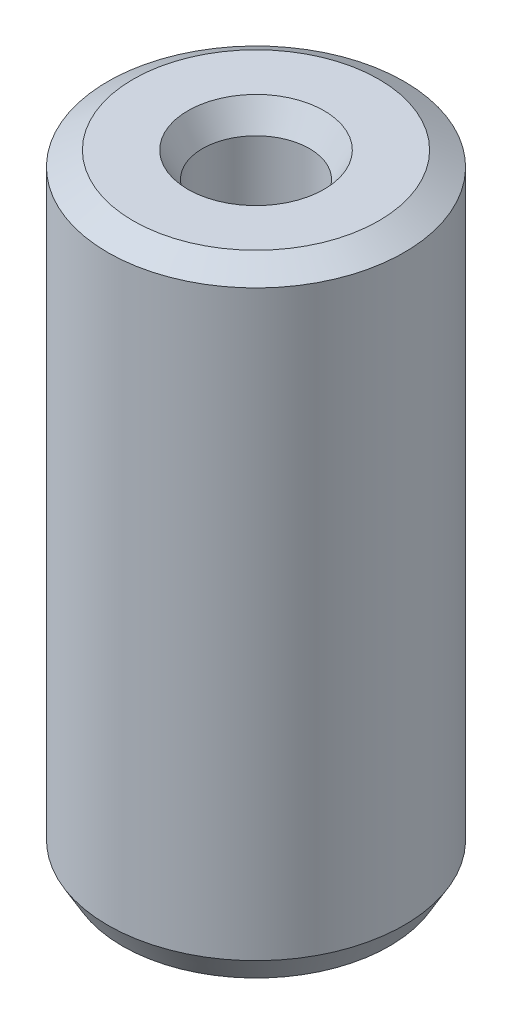
ISO-10303-21;
HEADER;
FILE_DESCRIPTION(('STEP AP214'),'2;1');
FILE_NAME('part.step','',(''),(''),'','','');
FILE_SCHEMA(('AUTOMOTIVE_DESIGN { 1 0 10303 214 1 1 1 1 }'));
ENDSEC;
DATA;
#1=APPLICATION_CONTEXT('core data for automotive mechanical design processes');
#2=APPLICATION_PROTOCOL_DEFINITION('international standard','automotive_design',2000,#1);
#3=PRODUCT_CONTEXT('',#1,'mechanical');
#4=PRODUCT('Part','Part','',(#3));
#5=PRODUCT_RELATED_PRODUCT_CATEGORY('part','',(#4));
#6=PRODUCT_DEFINITION_FORMATION('','',#4);
#7=PRODUCT_DEFINITION_CONTEXT('part definition',#1,'design');
#8=PRODUCT_DEFINITION('design','',#6,#7);
#9=PRODUCT_DEFINITION_SHAPE('','',#8);
#10=(LENGTH_UNIT() NAMED_UNIT(*) SI_UNIT(.MILLI.,.METRE.));
#11=(NAMED_UNIT(*) PLANE_ANGLE_UNIT() SI_UNIT($,.RADIAN.));
#12=(NAMED_UNIT(*) SI_UNIT($,.STERADIAN.) SOLID_ANGLE_UNIT());
#13=UNCERTAINTY_MEASURE_WITH_UNIT(LENGTH_MEASURE(1.E-05),#10,'distance_accuracy_value','');
#14=(GEOMETRIC_REPRESENTATION_CONTEXT(3) GLOBAL_UNCERTAINTY_ASSIGNED_CONTEXT((#13)) GLOBAL_UNIT_ASSIGNED_CONTEXT((#10,
#11,#12)) REPRESENTATION_CONTEXT('',''));
#15=CARTESIAN_POINT('',(0.,0.,0.));
#16=DIRECTION('',(0.,0.,1.));
#17=DIRECTION('',(1.,0.,0.));
#18=AXIS2_PLACEMENT_3D('',#15,#16,#17);
#19=CARTESIAN_POINT('',(0.,52.5242379681244,0.));
#20=DIRECTION('',(0.,-1.,0.));
#21=DIRECTION('',(0.,0.,-1.));
#22=AXIS2_PLACEMENT_3D('',#19,#20,#21);
#23=CYLINDRICAL_SURFACE('',#22,12.5);
#24=CARTESIAN_POINT('',(0.,2.14519332665176,0.));
#25=DIRECTION('',(0.,1.,0.));
#26=DIRECTION('',(0.,0.,1.));
#27=AXIS2_PLACEMENT_3D('',#24,#25,#26);
#28=CIRCLE('',#27,12.5);
#29=CARTESIAN_POINT('',(0.,2.14519332665176,-12.5));
#30=VERTEX_POINT('',#29);
#31=EDGE_CURVE('E10',#30,#30,#28,.T.);
#32=CARTESIAN_POINT('',(0.,51.2857100235182,0.));
#33=DIRECTION('',(0.,1.,0.));
#34=DIRECTION('',(0.,0.,1.));
#35=AXIS2_PLACEMENT_3D('',#32,#33,#34);
#36=CIRCLE('',#35,12.5);
#37=CARTESIAN_POINT('',(0.,51.2857100235182,-12.5));
#38=VERTEX_POINT('',#37);
#39=EDGE_CURVE('E50',#38,#38,#36,.F.);
#40=CARTESIAN_POINT('',(0.,2.14519332665176,-12.5));
#41=CARTESIAN_POINT('',(0.,2.65707370891078,-12.5));
#42=CARTESIAN_POINT('',(0.,3.16895409116981,-12.5));
#43=CARTESIAN_POINT('',(0.,4.19271485568786,-12.5));
#44=CARTESIAN_POINT('',(0.,4.70459523794689,-12.5));
#45=CARTESIAN_POINT('',(0.,5.72835600246494,-12.5));
#46=CARTESIAN_POINT('',(0.,6.24023638472396,-12.5));
#47=CARTESIAN_POINT('',(0.,7.26399714924201,-12.5));
#48=CARTESIAN_POINT('',(0.,7.77587753150104,-12.5));
#49=CARTESIAN_POINT('',(0.,8.79963829601909,-12.5));
#50=CARTESIAN_POINT('',(0.,9.31151867827812,-12.5));
#51=CARTESIAN_POINT('',(0.,10.3352794427962,-12.5));
#52=CARTESIAN_POINT('',(0.,10.8471598250552,-12.5));
#53=CARTESIAN_POINT('',(0.,11.8709205895732,-12.5));
#54=CARTESIAN_POINT('',(0.,12.3828009718323,-12.5));
#55=CARTESIAN_POINT('',(0.,13.4065617363503,-12.5));
#56=CARTESIAN_POINT('',(0.,13.9184421186093,-12.5));
#57=CARTESIAN_POINT('',(0.,14.9422028831274,-12.5));
#58=CARTESIAN_POINT('',(0.,15.4540832653864,-12.5));
#59=CARTESIAN_POINT('',(0.,16.4778440299045,-12.5));
#60=CARTESIAN_POINT('',(0.,16.9897244121635,-12.5));
#61=CARTESIAN_POINT('',(0.,18.0134851766816,-12.5));
#62=CARTESIAN_POINT('',(0.,18.5253655589406,-12.5));
#63=CARTESIAN_POINT('',(0.,19.5491263234586,-12.5));
#64=CARTESIAN_POINT('',(0.,20.0610067057177,-12.5));
#65=CARTESIAN_POINT('',(0.,21.0847674702357,-12.5));
#66=CARTESIAN_POINT('',(0.,21.5966478524947,-12.5));
#67=CARTESIAN_POINT('',(0.,22.6204086170128,-12.5));
#68=CARTESIAN_POINT('',(0.,23.1322889992718,-12.5));
#69=CARTESIAN_POINT('',(0.,24.1560497637899,-12.5));
#70=CARTESIAN_POINT('',(0.,24.6679301460489,-12.5));
#71=CARTESIAN_POINT('',(0.,25.6916909105669,-12.5));
#72=CARTESIAN_POINT('',(0.,26.203571292826,-12.5));
#73=CARTESIAN_POINT('',(0.,27.227332057344,-12.5));
#74=CARTESIAN_POINT('',(0.,27.739212439603,-12.5));
#75=CARTESIAN_POINT('',(0.,28.7629732041211,-12.5));
#76=CARTESIAN_POINT('',(0.,29.2748535863801,-12.5));
#77=CARTESIAN_POINT('',(0.,30.2986143508982,-12.5));
#78=CARTESIAN_POINT('',(0.,30.8104947331572,-12.5));
#79=CARTESIAN_POINT('',(0.,31.8342554976752,-12.5));
#80=CARTESIAN_POINT('',(0.,32.3461358799343,-12.5));
#81=CARTESIAN_POINT('',(0.,33.3698966444523,-12.5));
#82=CARTESIAN_POINT('',(0.,33.8817770267113,-12.5));
#83=CARTESIAN_POINT('',(0.,34.9055377912294,-12.5));
#84=CARTESIAN_POINT('',(0.,35.4174181734884,-12.5));
#85=CARTESIAN_POINT('',(0.,36.4411789380065,-12.5));
#86=CARTESIAN_POINT('',(0.,36.9530593202655,-12.5));
#87=CARTESIAN_POINT('',(0.,37.9768200847835,-12.5));
#88=CARTESIAN_POINT('',(0.,38.4887004670426,-12.5));
#89=CARTESIAN_POINT('',(0.,39.5124612315606,-12.5));
#90=CARTESIAN_POINT('',(0.,40.0243416138197,-12.5));
#91=CARTESIAN_POINT('',(0.,41.0481023783377,-12.5));
#92=CARTESIAN_POINT('',(0.,41.5599827605967,-12.5));
#93=CARTESIAN_POINT('',(0.,42.5837435251148,-12.5));
#94=CARTESIAN_POINT('',(0.,43.0956239073738,-12.5));
#95=CARTESIAN_POINT('',(0.,44.1193846718919,-12.5));
#96=CARTESIAN_POINT('',(0.,44.6312650541509,-12.5));
#97=CARTESIAN_POINT('',(0.,45.6550258186689,-12.5));
#98=CARTESIAN_POINT('',(0.,46.166906200928,-12.5));
#99=CARTESIAN_POINT('',(0.,47.190666965446,-12.5));
#100=CARTESIAN_POINT('',(0.,47.702547347705,-12.5));
#101=CARTESIAN_POINT('',(0.,48.7263081122231,-12.5));
#102=CARTESIAN_POINT('',(0.,49.2381884944821,-12.5));
#103=CARTESIAN_POINT('',(0.,50.2619492590002,-12.5));
#104=CARTESIAN_POINT('',(0.,50.7738296412592,-12.5));
#105=CARTESIAN_POINT('',(0.,51.2857100235182,-12.5));
#106=B_SPLINE_CURVE_WITH_KNOTS('',3,(#40,#41,#42,#43,#44,#45,#46,#47,#48,#49,#50,#51,#52,#53,
#54,#55,#56,#57,#58,#59,#60,#61,#62,#63,#64,#65,#66,#67,#68,#69,#70,#71,#72,#73,#74,#75,#76,#77,
#78,#79,#80,#81,#82,#83,#84,#85,#86,#87,#88,#89,#90,#91,#92,#93,#94,#95,#96,#97,#98,#99,#100,
#101,#102,#103,#104,#105),.UNSPECIFIED.,.F.,.F.,(4,2,2,2,2,2,2,2,2,2,2,2,2,2,2,2,2,2,2,2,2,2,2,
2,2,2,2,2,2,2,2,2,4),(0.,1.53564114677707,3.07128229355415,4.60692344033123,6.14256458710831,
7.67820573388538,9.21384688066246,10.7494880274395,12.2851291742166,13.8207703209937,
15.3564114677708,16.8920526145478,18.4276937613249,19.963334908102,21.4989760548791,
23.0346172016562,24.5702583484332,26.1058994952103,27.6415406419874,29.1771817887645,
30.7128229355415,32.2484640823186,33.7841052290957,35.3197463758728,36.8553875226498,
38.3910286694269,39.926669816204,41.4623109629811,42.9979521097582,44.5335932565352,
46.0692344033123,47.6048755500894,49.1405166968665),.UNSPECIFIED.);
#107=EDGE_CURVE('BSEAM39',#30,#38,#106,.T.);
#108=ORIENTED_EDGE('',*,*,#31,.T.);
#109=ORIENTED_EDGE('',*,*,#39,.T.);
#110=ORIENTED_EDGE('',*,*,#107,.T.);
#111=ORIENTED_EDGE('',*,*,#107,.F.);
#112=EDGE_LOOP('',(#108,#110,#109,#111));
#113=FACE_BOUND('',#112,.T.);
#114=ADVANCED_FACE('F39',(#113),#23,.T.);
#115=CARTESIAN_POINT('',(0.,52.5242379681244,0.));
#116=DIRECTION('',(0.,1.,0.));
#117=DIRECTION('',(0.,0.,1.));
#118=AXIS2_PLACEMENT_3D('',#115,#116,#117);
#119=PLANE('',#118);
#120=CARTESIAN_POINT('',(0.,52.5242379681244,0.));
#121=DIRECTION('',(0.,1.,0.));
#122=DIRECTION('',(0.,0.,1.));
#123=AXIS2_PLACEMENT_3D('',#120,#121,#122);
#124=CIRCLE('',#123,5.74691489921022);
#125=CARTESIAN_POINT('',(0.,52.5242379681244,5.74691489921022));
#126=VERTEX_POINT('',#125);
#127=EDGE_CURVE('E58',#126,#126,#124,.F.);
#128=ORIENTED_EDGE('',*,*,#127,.T.);
#129=EDGE_LOOP('',(#128));
#130=FACE_BOUND('',#129,.T.);
#131=CARTESIAN_POINT('',(0.,52.5242379681244,0.));
#132=DIRECTION('',(0.,1.,0.));
#133=DIRECTION('',(0.,0.,1.));
#134=AXIS2_PLACEMENT_3D('',#131,#132,#133);
#135=CIRCLE('',#134,10.3548066733483);
#136=CARTESIAN_POINT('',(0.,52.5242379681244,10.3548066733483));
#137=VERTEX_POINT('',#136);
#138=EDGE_CURVE('E61',#137,#137,#135,.T.);
#139=ORIENTED_EDGE('',*,*,#138,.T.);
#140=EDGE_LOOP('',(#139));
#141=FACE_BOUND('',#140,.T.);
#142=ADVANCED_FACE('F88',(#130,#141),#119,.T.);
#143=CARTESIAN_POINT('',(0.,0.,0.));
#144=DIRECTION('',(0.,1.,0.));
#145=DIRECTION('',(0.,0.,1.));
#146=AXIS2_PLACEMENT_3D('',#143,#144,#145);
#147=PLANE('',#146);
#148=CARTESIAN_POINT('',(0.,0.,0.));
#149=DIRECTION('',(0.,1.,0.));
#150=DIRECTION('',(0.,0.,1.));
#151=AXIS2_PLACEMENT_3D('',#148,#149,#150);
#152=CIRCLE('',#151,6.6535802812557);
#153=CARTESIAN_POINT('',(0.,0.,-6.6535802812557));
#154=VERTEX_POINT('',#153);
#155=EDGE_CURVE('E51',#154,#154,#152,.T.);
#156=ORIENTED_EDGE('',*,*,#155,.T.);
#157=EDGE_LOOP('',(#156));
#158=FACE_BOUND('',#157,.T.);
#159=CARTESIAN_POINT('',(0.,0.,0.));
#160=DIRECTION('',(0.,1.,0.));
#161=DIRECTION('',(0.,0.,1.));
#162=AXIS2_PLACEMENT_3D('',#159,#160,#161);
#163=CIRCLE('',#162,11.2614720553938);
#164=CARTESIAN_POINT('',(0.,0.,11.2614720553938));
#165=VERTEX_POINT('',#164);
#166=EDGE_CURVE('E54',#165,#165,#163,.F.);
#167=ORIENTED_EDGE('',*,*,#166,.T.);
#168=EDGE_LOOP('',(#167));
#169=FACE_BOUND('',#168,.T.);
#170=ADVANCED_FACE('F83',(#158,#169),#147,.F.);
#171=CARTESIAN_POINT('',(0.,52.5242379681244,0.));
#172=DIRECTION('',(0.,-1.,0.));
#173=DIRECTION('',(0.,0.,-1.));
#174=AXIS2_PLACEMENT_3D('',#171,#172,#173);
#175=CYLINDRICAL_SURFACE('',#174,4.50838695460403);
#176=CARTESIAN_POINT('',(0.,50.3790446414726,0.));
#177=DIRECTION('',(0.,1.,0.));
#178=DIRECTION('',(0.,0.,1.));
#179=AXIS2_PLACEMENT_3D('',#176,#177,#178);
#180=CIRCLE('',#179,4.50838695460403);
#181=CARTESIAN_POINT('',(0.,50.3790446414726,-4.50838695460403));
#182=VERTEX_POINT('',#181);
#183=EDGE_CURVE('E67',#182,#182,#180,.T.);
#184=CARTESIAN_POINT('',(0.,1.23852794460615,0.));
#185=DIRECTION('',(0.,1.,0.));
#186=DIRECTION('',(0.,0.,1.));
#187=AXIS2_PLACEMENT_3D('',#184,#185,#186);
#188=CIRCLE('',#187,4.50838695460403);
#189=CARTESIAN_POINT('',(0.,1.23852794460615,-4.50838695460403));
#190=VERTEX_POINT('',#189);
#191=EDGE_CURVE('E69',#190,#190,#188,.F.);
#192=CARTESIAN_POINT('',(0.,50.3790446414726,-4.50838695460403));
#193=CARTESIAN_POINT('',(0.,49.8671642592136,-4.50838695460403));
#194=CARTESIAN_POINT('',(0.,49.3552838769546,-4.50838695460403));
#195=CARTESIAN_POINT('',(0.,48.3315231124365,-4.50838695460403));
#196=CARTESIAN_POINT('',(0.,47.8196427301775,-4.50838695460403));
#197=CARTESIAN_POINT('',(0.,46.7958819656594,-4.50838695460403));
#198=CARTESIAN_POINT('',(0.,46.2840015834004,-4.50838695460403));
#199=CARTESIAN_POINT('',(0.,45.2602408188824,-4.50838695460403));
#200=CARTESIAN_POINT('',(0.,44.7483604366233,-4.50838695460403));
#201=CARTESIAN_POINT('',(0.,43.7245996721053,-4.50838695460403));
#202=CARTESIAN_POINT('',(0.,43.2127192898463,-4.50838695460403));
#203=CARTESIAN_POINT('',(0.,42.1889585253282,-4.50838695460403));
#204=CARTESIAN_POINT('',(0.,41.6770781430692,-4.50838695460403));
#205=CARTESIAN_POINT('',(0.,40.6533173785511,-4.50838695460403));
#206=CARTESIAN_POINT('',(0.,40.1414369962921,-4.50838695460403));
#207=CARTESIAN_POINT('',(0.,39.1176762317741,-4.50838695460403));
#208=CARTESIAN_POINT('',(0.,38.605795849515,-4.50838695460403));
#209=CARTESIAN_POINT('',(0.,37.582035084997,-4.50838695460403));
#210=CARTESIAN_POINT('',(0.,37.070154702738,-4.50838695460403));
#211=CARTESIAN_POINT('',(0.,36.0463939382199,-4.50838695460403));
#212=CARTESIAN_POINT('',(0.,35.5345135559609,-4.50838695460403));
#213=CARTESIAN_POINT('',(0.,34.5107527914428,-4.50838695460403));
#214=CARTESIAN_POINT('',(0.,33.9988724091838,-4.50838695460403));
#215=CARTESIAN_POINT('',(0.,32.9751116446658,-4.50838695460403));
#216=CARTESIAN_POINT('',(0.,32.4632312624067,-4.50838695460403));
#217=CARTESIAN_POINT('',(0.,31.4394704978887,-4.50838695460403));
#218=CARTESIAN_POINT('',(0.,30.9275901156296,-4.50838695460403));
#219=CARTESIAN_POINT('',(0.,29.9038293511116,-4.50838695460403));
#220=CARTESIAN_POINT('',(0.,29.3919489688526,-4.50838695460403));
#221=CARTESIAN_POINT('',(0.,28.3681882043345,-4.50838695460403));
#222=CARTESIAN_POINT('',(0.,27.8563078220755,-4.50838695460403));
#223=CARTESIAN_POINT('',(0.,26.8325470575574,-4.50838695460403));
#224=CARTESIAN_POINT('',(0.,26.3206666752984,-4.50838695460403));
#225=CARTESIAN_POINT('',(0.,25.2969059107804,-4.50838695460403));
#226=CARTESIAN_POINT('',(0.,24.7850255285213,-4.50838695460403));
#227=CARTESIAN_POINT('',(0.,23.7612647640033,-4.50838695460403));
#228=CARTESIAN_POINT('',(0.,23.2493843817443,-4.50838695460403));
#229=CARTESIAN_POINT('',(0.,22.2256236172262,-4.50838695460403));
#230=CARTESIAN_POINT('',(0.,21.7137432349672,-4.50838695460403));
#231=CARTESIAN_POINT('',(0.,20.6899824704491,-4.50838695460403));
#232=CARTESIAN_POINT('',(0.,20.1781020881901,-4.50838695460403));
#233=CARTESIAN_POINT('',(0.,19.1543413236721,-4.50838695460403));
#234=CARTESIAN_POINT('',(0.,18.642460941413,-4.50838695460403));
#235=CARTESIAN_POINT('',(0.,17.618700176895,-4.50838695460403));
#236=CARTESIAN_POINT('',(0.,17.106819794636,-4.50838695460403));
#237=CARTESIAN_POINT('',(0.,16.0830590301179,-4.50838695460403));
#238=CARTESIAN_POINT('',(0.,15.5711786478589,-4.50838695460403));
#239=CARTESIAN_POINT('',(0.,14.5474178833408,-4.50838695460403));
#240=CARTESIAN_POINT('',(0.,14.0355375010818,-4.50838695460403));
#241=CARTESIAN_POINT('',(0.,13.0117767365637,-4.50838695460403));
#242=CARTESIAN_POINT('',(0.,12.4998963543047,-4.50838695460403));
#243=CARTESIAN_POINT('',(0.,11.4761355897867,-4.50838695460403));
#244=CARTESIAN_POINT('',(0.,10.9642552075276,-4.50838695460403));
#245=CARTESIAN_POINT('',(0.,9.9404944430096,-4.50838695460403));
#246=CARTESIAN_POINT('',(0.,9.42861406075057,-4.50838695460403));
#247=CARTESIAN_POINT('',(0.,8.40485329623252,-4.50838695460403));
#248=CARTESIAN_POINT('',(0.,7.89297291397349,-4.50838695460403));
#249=CARTESIAN_POINT('',(0.,6.86921214945544,-4.50838695460403));
#250=CARTESIAN_POINT('',(0.,6.35733176719641,-4.50838695460403));
#251=CARTESIAN_POINT('',(0.,5.33357100267836,-4.50838695460403));
#252=CARTESIAN_POINT('',(0.,4.82169062041934,-4.50838695460403));
#253=CARTESIAN_POINT('',(0.,3.79792985590129,-4.50838695460403));
#254=CARTESIAN_POINT('',(0.,3.28604947364226,-4.50838695460403));
#255=CARTESIAN_POINT('',(0.,2.26228870912421,-4.50838695460403));
#256=CARTESIAN_POINT('',(0.,1.75040832686518,-4.50838695460403));
#257=CARTESIAN_POINT('',(0.,1.23852794460615,-4.50838695460403));
#258=B_SPLINE_CURVE_WITH_KNOTS('',3,(#192,#193,#194,#195,#196,#197,#198,#199,#200,#201,#202,
#203,#204,#205,#206,#207,#208,#209,#210,#211,#212,#213,#214,#215,#216,#217,#218,#219,#220,#221,
#222,#223,#224,#225,#226,#227,#228,#229,#230,#231,#232,#233,#234,#235,#236,#237,#238,#239,#240,
#241,#242,#243,#244,#245,#246,#247,#248,#249,#250,#251,#252,#253,#254,#255,#256,#257),
.UNSPECIFIED.,.F.,.F.,(4,2,2,2,2,2,2,2,2,2,2,2,2,2,2,2,2,2,2,2,2,2,2,2,2,2,2,2,2,2,2,2,4),(0.,
1.53564114677708,3.07128229355415,4.60692344033124,6.14256458710831,7.67820573388539,
9.21384688066246,10.7494880274395,12.2851291742166,13.8207703209937,15.3564114677708,
16.8920526145479,18.4276937613249,19.963334908102,21.4989760548791,23.0346172016562,
24.5702583484332,26.1058994952103,27.6415406419874,29.1771817887645,30.7128229355415,
32.2484640823186,33.7841052290957,35.3197463758728,36.8553875226499,38.3910286694269,
39.926669816204,41.4623109629811,42.9979521097582,44.5335932565352,46.0692344033123,
47.6048755500894,49.1405166968665),.UNSPECIFIED.);
#259=EDGE_CURVE('BSEAM71',#182,#190,#258,.T.);
#260=ORIENTED_EDGE('',*,*,#183,.T.);
#261=ORIENTED_EDGE('',*,*,#191,.T.);
#262=ORIENTED_EDGE('',*,*,#259,.T.);
#263=ORIENTED_EDGE('',*,*,#259,.F.);
#264=EDGE_LOOP('',(#260,#262,#261,#263));
#265=FACE_BOUND('',#264,.T.);
#266=ADVANCED_FACE('F71',(#265),#175,.F.);
#267=CARTESIAN_POINT('',(0.,50.3790446414726,0.));
#268=DIRECTION('',(0.,1.,0.));
#269=DIRECTION('',(0.,0.,1.));
#270=AXIS2_PLACEMENT_3D('',#267,#268,#269);
#271=CONICAL_SURFACE('',#270,4.50838695460403,0.523598775598305);
#272=ORIENTED_EDGE('',*,*,#127,.F.);
#273=EDGE_LOOP('',(#272));
#274=FACE_BOUND('',#273,.T.);
#275=ORIENTED_EDGE('',*,*,#183,.F.);
#276=EDGE_LOOP('',(#275));
#277=FACE_BOUND('',#276,.T.);
#278=ADVANCED_FACE('F77',(#274,#277),#271,.F.);
#279=CARTESIAN_POINT('',(0.,0.,0.));
#280=DIRECTION('',(0.,-1.,0.));
#281=DIRECTION('',(0.,0.,-1.));
#282=AXIS2_PLACEMENT_3D('',#279,#280,#281);
#283=CONICAL_SURFACE('',#282,6.6535802812557,1.04719755119659);
#284=CARTESIAN_POINT('',(0.,1.23852794460615,-4.50838695460403));
#285=CARTESIAN_POINT('',(0.,1.22562661184984,-4.53073271842332));
#286=CARTESIAN_POINT('',(0.,1.21272527909353,-4.5530784822426));
#287=CARTESIAN_POINT('',(0.,1.1869226135809,-4.59777000988118));
#288=CARTESIAN_POINT('',(0.,1.17402128082458,-4.62011577370047));
#289=CARTESIAN_POINT('',(0.,1.14821861531195,-4.66480730133904));
#290=CARTESIAN_POINT('',(0.,1.13531728255564,-4.68715306515833));
#291=CARTESIAN_POINT('',(0.,1.10951461704301,-4.73184459279691));
#292=CARTESIAN_POINT('',(0.,1.0966132842867,-4.7541903566162));
#293=CARTESIAN_POINT('',(0.,1.07081061877407,-4.79888188425477));
#294=CARTESIAN_POINT('',(0.,1.05790928601776,-4.82122764807406));
#295=CARTESIAN_POINT('',(0.,1.03210662050513,-4.86591917571264));
#296=CARTESIAN_POINT('',(0.,1.01920528774881,-4.88826493953193));
#297=CARTESIAN_POINT('',(0.,0.993402622236186,-4.9329564671705));
#298=CARTESIAN_POINT('',(0.,0.980501289479871,-4.95530223098979));
#299=CARTESIAN_POINT('',(0.,0.954698623967243,-4.99999375862837));
#300=CARTESIAN_POINT('',(0.,0.941797291210929,-5.02233952244766));
#301=CARTESIAN_POINT('',(0.,0.915994625698301,-5.06703105008623));
#302=CARTESIAN_POINT('',(0.,0.903093292941987,-5.08937681390552));
#303=CARTESIAN_POINT('',(0.,0.877290627429359,-5.1340683415441));
#304=CARTESIAN_POINT('',(0.,0.864389294673044,-5.15641410536339));
#305=CARTESIAN_POINT('',(0.,0.838586629160416,-5.20110563300196));
#306=CARTESIAN_POINT('',(0.,0.825685296404102,-5.22345139682125));
#307=CARTESIAN_POINT('',(0.,0.799882630891474,-5.26814292445983));
#308=CARTESIAN_POINT('',(0.,0.78698129813516,-5.29048868827912));
#309=CARTESIAN_POINT('',(0.,0.761178632622532,-5.33518021591769));
#310=CARTESIAN_POINT('',(0.,0.748277299866218,-5.35752597973698));
#311=CARTESIAN_POINT('',(0.,0.722474634353589,-5.40221750737556));
#312=CARTESIAN_POINT('',(0.,0.709573301597275,-5.42456327119485));
#313=CARTESIAN_POINT('',(0.,0.683770636084647,-5.46925479883342));
#314=CARTESIAN_POINT('',(0.,0.670869303328333,-5.49160056265271));
#315=CARTESIAN_POINT('',(0.,0.645066637815705,-5.53629209029129));
#316=CARTESIAN_POINT('',(0.,0.632165305059391,-5.55863785411058));
#317=CARTESIAN_POINT('',(0.,0.606362639546763,-5.60332938174915));
#318=CARTESIAN_POINT('',(0.,0.593461306790448,-5.62567514556844));
#319=CARTESIAN_POINT('',(0.,0.56765864127782,-5.67036667320702));
#320=CARTESIAN_POINT('',(0.,0.554757308521506,-5.69271243702631));
#321=CARTESIAN_POINT('',(0.,0.528954643008878,-5.73740396466488));
#322=CARTESIAN_POINT('',(0.,0.516053310252564,-5.75974972848417));
#323=CARTESIAN_POINT('',(0.,0.490250644739936,-5.80444125612275));
#324=CARTESIAN_POINT('',(0.,0.477349311983622,-5.82678701994204));
#325=CARTESIAN_POINT('',(0.,0.451546646470993,-5.87147854758061));
#326=CARTESIAN_POINT('',(0.,0.438645313714679,-5.8938243113999));
#327=CARTESIAN_POINT('',(0.,0.412842648202051,-5.93851583903848));
#328=CARTESIAN_POINT('',(0.,0.399941315445737,-5.96086160285777));
#329=CARTESIAN_POINT('',(0.,0.374138649933109,-6.00555313049634));
#330=CARTESIAN_POINT('',(0.,0.361237317176795,-6.02789889431563));
#331=CARTESIAN_POINT('',(0.,0.335434651664167,-6.07259042195421));
#332=CARTESIAN_POINT('',(0.,0.322533318907852,-6.0949361857735));
#333=CARTESIAN_POINT('',(0.,0.296730653395224,-6.13962771341207));
#334=CARTESIAN_POINT('',(0.,0.28382932063891,-6.16197347723136));
#335=CARTESIAN_POINT('',(0.,0.258026655126282,-6.20666500486994));
#336=CARTESIAN_POINT('',(0.,0.245125322369968,-6.22901076868923));
#337=CARTESIAN_POINT('',(0.,0.21932265685734,-6.2737022963278));
#338=CARTESIAN_POINT('',(0.,0.206421324101025,-6.29604806014709));
#339=CARTESIAN_POINT('',(0.,0.180618658588397,-6.34073958778567));
#340=CARTESIAN_POINT('',(0.,0.167717325832083,-6.36308535160496));
#341=CARTESIAN_POINT('',(0.,0.141914660319455,-6.40777687924353));
#342=CARTESIAN_POINT('',(0.,0.129013327563141,-6.43012264306282));
#343=CARTESIAN_POINT('',(0.,0.103210662050513,-6.4748141707014));
#344=CARTESIAN_POINT('',(0.,0.0903093292941986,-6.49715993452069));
#345=CARTESIAN_POINT('',(0.,0.0645066637815704,-6.54185146215926));
#346=CARTESIAN_POINT('',(0.,0.0516053310252564,-6.56419722597855));
#347=CARTESIAN_POINT('',(0.,0.0258026655126283,-6.60888875361713));
#348=CARTESIAN_POINT('',(0.,0.0129013327563143,-6.63123451743642));
#349=CARTESIAN_POINT('',(0.,0.,-6.6535802812557));
#350=B_SPLINE_CURVE_WITH_KNOTS('',3,(#284,#285,#286,#287,#288,#289,#290,#291,#292,#293,#294,
#295,#296,#297,#298,#299,#300,#301,#302,#303,#304,#305,#306,#307,#308,#309,#310,#311,#312,#313,
#314,#315,#316,#317,#318,#319,#320,#321,#322,#323,#324,#325,#326,#327,#328,#329,#330,#331,#332,
#333,#334,#335,#336,#337,#338,#339,#340,#341,#342,#343,#344,#345,#346,#347,#348,#349),
.UNSPECIFIED.,.F.,.F.,(4,2,2,2,2,2,2,2,2,2,2,2,2,2,2,2,2,2,2,2,2,2,2,2,2,2,2,2,2,2,2,2,4),(0.,
0.0774079965378835,0.154815993075767,0.232223989613651,0.309631986151535,0.387039982689418,
0.464447979227302,0.541855975765186,0.619263972303069,0.696671968840953,0.774079965378837,
0.85148796191672,0.928895958454604,1.00630395499249,1.08371195153037,1.16111994806826,
1.23852794460614,1.31593594114402,1.39334393768191,1.47075193421979,1.54815993075767,
1.62556792729556,1.70297592383344,1.78038392037133,1.85779191690921,1.93519991344709,
2.01260790998498,2.09001590652286,2.16742390306074,2.24483189959863,2.32223989613651,
2.39964789267439,2.47705588921228),.UNSPECIFIED.);
#351=EDGE_CURVE('BSEAM73',#190,#154,#350,.T.);
#352=ORIENTED_EDGE('',*,*,#191,.F.);
#353=ORIENTED_EDGE('',*,*,#155,.F.);
#354=ORIENTED_EDGE('',*,*,#351,.T.);
#355=ORIENTED_EDGE('',*,*,#351,.F.);
#356=EDGE_LOOP('',(#352,#354,#353,#355));
#357=FACE_BOUND('',#356,.T.);
#358=ADVANCED_FACE('F73',(#357),#283,.F.);
#359=CARTESIAN_POINT('',(0.,2.14519332665176,0.));
#360=DIRECTION('',(0.,1.,0.));
#361=DIRECTION('',(0.,0.,1.));
#362=AXIS2_PLACEMENT_3D('',#359,#360,#361);
#363=CONICAL_SURFACE('',#362,12.5,0.523598775598303);
#364=ORIENTED_EDGE('',*,*,#166,.F.);
#365=EDGE_LOOP('',(#364));
#366=FACE_BOUND('',#365,.T.);
#367=ORIENTED_EDGE('',*,*,#31,.F.);
#368=EDGE_LOOP('',(#367));
#369=FACE_BOUND('',#368,.T.);
#370=ADVANCED_FACE('F76',(#366,#369),#363,.T.);
#371=CARTESIAN_POINT('',(0.,52.5242379681244,0.));
#372=DIRECTION('',(0.,-1.,0.));
#373=DIRECTION('',(0.,0.,-1.));
#374=AXIS2_PLACEMENT_3D('',#371,#372,#373);
#375=CONICAL_SURFACE('',#374,10.3548066733483,1.0471975511966);
#376=ORIENTED_EDGE('',*,*,#39,.F.);
#377=EDGE_LOOP('',(#376));
#378=FACE_BOUND('',#377,.T.);
#379=ORIENTED_EDGE('',*,*,#138,.F.);
#380=EDGE_LOOP('',(#379));
#381=FACE_BOUND('',#380,.T.);
#382=ADVANCED_FACE('F45',(#378,#381),#375,.T.);
#383=CLOSED_SHELL('',(#114,#142,#170,#266,#278,#358,#370,#382));
#384=MANIFOLD_SOLID_BREP('B2',#383);
#385=ADVANCED_BREP_SHAPE_REPRESENTATION('',(#18,#384),#14);
#386=SHAPE_DEFINITION_REPRESENTATION(#9,#385);
ENDSEC;
END-ISO-10303-21;
